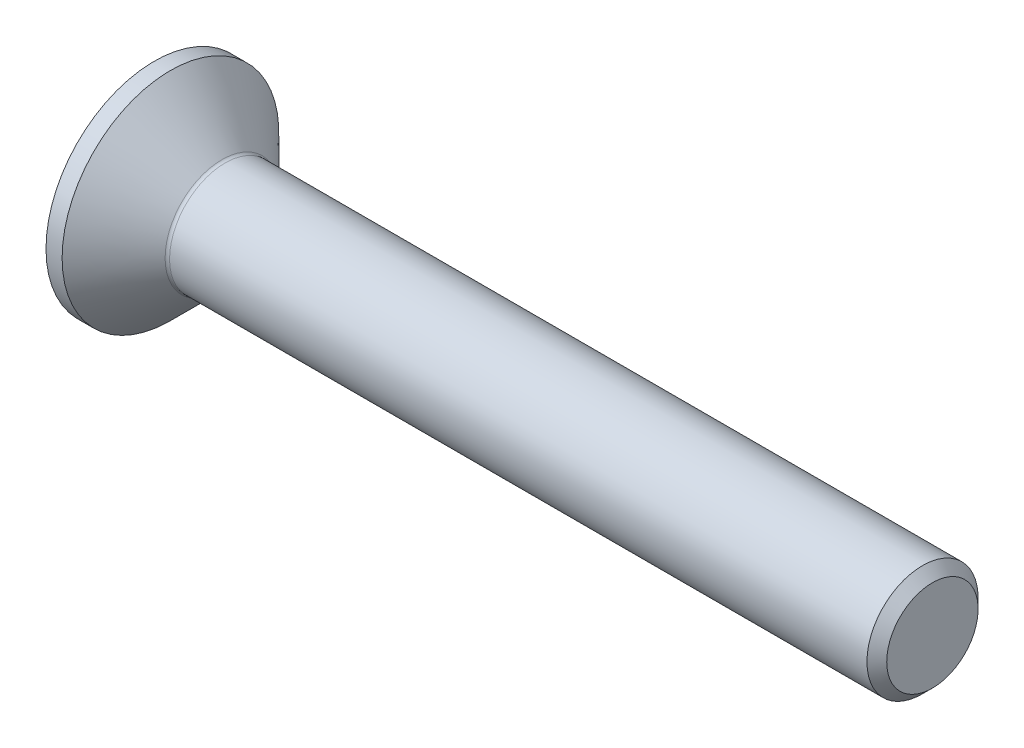
ISO-10303-21;
HEADER;
FILE_DESCRIPTION(('STEP AP214'),'2;1');
FILE_NAME('part.step','',(''),(''),'','','');
FILE_SCHEMA(('AUTOMOTIVE_DESIGN { 1 0 10303 214 1 1 1 1 }'));
ENDSEC;
DATA;
#1=APPLICATION_CONTEXT('core data for automotive mechanical design processes');
#2=APPLICATION_PROTOCOL_DEFINITION('international standard','automotive_design',2000,#1);
#3=PRODUCT_CONTEXT('',#1,'mechanical');
#4=PRODUCT('Part','Part','',(#3));
#5=PRODUCT_RELATED_PRODUCT_CATEGORY('part','',(#4));
#6=PRODUCT_DEFINITION_FORMATION('','',#4);
#7=PRODUCT_DEFINITION_CONTEXT('part definition',#1,'design');
#8=PRODUCT_DEFINITION('design','',#6,#7);
#9=PRODUCT_DEFINITION_SHAPE('','',#8);
#10=(LENGTH_UNIT() NAMED_UNIT(*) SI_UNIT(.MILLI.,.METRE.));
#11=(NAMED_UNIT(*) PLANE_ANGLE_UNIT() SI_UNIT($,.RADIAN.));
#12=(NAMED_UNIT(*) SI_UNIT($,.STERADIAN.) SOLID_ANGLE_UNIT());
#13=UNCERTAINTY_MEASURE_WITH_UNIT(LENGTH_MEASURE(1.E-05),#10,'distance_accuracy_value','');
#14=(GEOMETRIC_REPRESENTATION_CONTEXT(3) GLOBAL_UNCERTAINTY_ASSIGNED_CONTEXT((#13)) GLOBAL_UNIT_ASSIGNED_CONTEXT((#10,
#11,#12)) REPRESENTATION_CONTEXT('',''));
#15=CARTESIAN_POINT('',(0.,0.,0.));
#16=DIRECTION('',(0.,0.,1.));
#17=DIRECTION('',(1.,0.,0.));
#18=AXIS2_PLACEMENT_3D('',#15,#16,#17);
#19=CARTESIAN_POINT('',(0.,0.,0.));
#20=DIRECTION('',(-1.,0.,0.));
#21=DIRECTION('',(0.,0.,1.));
#22=AXIS2_PLACEMENT_3D('',#19,#20,#21);
#23=PLANE('',#22);
#24=CARTESIAN_POINT('',(0.,0.,0.));
#25=DIRECTION('',(-1.,0.,0.));
#26=DIRECTION('',(0.,0.,1.));
#27=AXIS2_PLACEMENT_3D('',#24,#25,#26);
#28=CIRCLE('',#27,4.875);
#29=CARTESIAN_POINT('',(0.,0.,4.875));
#30=VERTEX_POINT('',#29);
#31=EDGE_CURVE('E157',#30,#30,#28,.T.);
#32=ORIENTED_EDGE('',*,*,#31,.T.);
#33=EDGE_LOOP('',(#32));
#34=FACE_BOUND('',#33,.T.);
#35=DIRECTION('',(0.,-0.5,-0.866025403784439));
#36=VECTOR('',#35,1.);
#37=CARTESIAN_POINT('',(0.,-0.866025403784439,1.5));
#38=LINE('',#37,#36);
#39=CARTESIAN_POINT('',(0.,-0.866025403784439,1.5));
#40=VERTEX_POINT('',#39);
#41=CARTESIAN_POINT('',(0.,-1.73205080756888,0.));
#42=VERTEX_POINT('',#41);
#43=EDGE_CURVE('E119',#40,#42,#38,.T.);
#44=ORIENTED_EDGE('',*,*,#43,.T.);
#45=DIRECTION('',(0.,0.500000000000001,-0.866025403784438));
#46=VECTOR('',#45,1.);
#47=CARTESIAN_POINT('',(0.,-1.73205080756888,0.));
#48=LINE('',#47,#46);
#49=CARTESIAN_POINT('',(0.,-0.866025403784438,-1.5));
#50=VERTEX_POINT('',#49);
#51=EDGE_CURVE('E49',#42,#50,#48,.T.);
#52=ORIENTED_EDGE('',*,*,#51,.T.);
#53=DIRECTION('',(0.,1.,0.));
#54=VECTOR('',#53,1.);
#55=CARTESIAN_POINT('',(0.,-0.866025403784438,-1.5));
#56=LINE('',#55,#54);
#57=CARTESIAN_POINT('',(0.,0.866025403784438,-1.5));
#58=VERTEX_POINT('',#57);
#59=EDGE_CURVE('E134',#50,#58,#56,.T.);
#60=ORIENTED_EDGE('',*,*,#59,.T.);
#61=DIRECTION('',(0.,0.499999999999999,0.866025403784439));
#62=VECTOR('',#61,1.);
#63=CARTESIAN_POINT('',(0.,0.866025403784438,-1.5));
#64=LINE('',#63,#62);
#65=CARTESIAN_POINT('',(0.,1.73205080756888,0.));
#66=VERTEX_POINT('',#65);
#67=EDGE_CURVE('E270',#58,#66,#64,.T.);
#68=ORIENTED_EDGE('',*,*,#67,.T.);
#69=DIRECTION('',(0.,-0.5,0.866025403784439));
#70=VECTOR('',#69,1.);
#71=CARTESIAN_POINT('',(0.,1.73205080756888,0.));
#72=LINE('',#71,#70);
#73=CARTESIAN_POINT('',(0.,0.866025403784438,1.5));
#74=VERTEX_POINT('',#73);
#75=EDGE_CURVE('E273',#66,#74,#72,.T.);
#76=ORIENTED_EDGE('',*,*,#75,.T.);
#77=DIRECTION('',(0.,-1.,0.));
#78=VECTOR('',#77,1.);
#79=CARTESIAN_POINT('',(0.,0.866025403784438,1.5));
#80=LINE('',#79,#78);
#81=EDGE_CURVE('E276',#74,#40,#80,.T.);
#82=ORIENTED_EDGE('',*,*,#81,.T.);
#83=EDGE_LOOP('',(#44,#52,#60,#68,#76,#82));
#84=FACE_BOUND('',#83,.T.);
#85=ADVANCED_FACE('F34',(#34,#84),#23,.T.);
#86=CARTESIAN_POINT('',(0.,0.,0.));
#87=DIRECTION('',(-1.,0.,0.));
#88=DIRECTION('',(0.,0.,1.));
#89=AXIS2_PLACEMENT_3D('',#86,#87,#88);
#90=CYLINDRICAL_SURFACE('',#89,4.875);
#91=CARTESIAN_POINT('',(0.725000000000013,0.,0.));
#92=DIRECTION('',(-1.,0.,0.));
#93=DIRECTION('',(0.,0.,1.));
#94=AXIS2_PLACEMENT_3D('',#91,#92,#93);
#95=CIRCLE('',#94,4.875);
#96=CARTESIAN_POINT('',(0.725000000000013,0.,4.875));
#97=VERTEX_POINT('',#96);
#98=EDGE_CURVE('E154',#97,#97,#95,.T.);
#99=ORIENTED_EDGE('',*,*,#98,.T.);
#100=EDGE_LOOP('',(#99));
#101=FACE_BOUND('',#100,.T.);
#102=ORIENTED_EDGE('',*,*,#31,.F.);
#103=EDGE_LOOP('',(#102));
#104=FACE_BOUND('',#103,.T.);
#105=ADVANCED_FACE('F178',(#101,#104),#90,.T.);
#106=CARTESIAN_POINT('',(0.725000000000013,0.,0.));
#107=DIRECTION('',(-1.,0.,0.));
#108=DIRECTION('',(0.,0.,1.));
#109=AXIS2_PLACEMENT_3D('',#106,#107,#108);
#110=CONICAL_SURFACE('',#109,4.875,0.78539816339745);
#111=CARTESIAN_POINT('',(3.04142135623743,0.,0.));
#112=DIRECTION('',(-1.,0.,0.));
#113=DIRECTION('',(0.,0.,1.));
#114=AXIS2_PLACEMENT_3D('',#111,#112,#113);
#115=CIRCLE('',#114,2.55857864376258);
#116=CARTESIAN_POINT('',(3.04142135623743,0.,2.55857864376258));
#117=VERTEX_POINT('',#116);
#118=EDGE_CURVE('E42',#117,#117,#115,.T.);
#119=ORIENTED_EDGE('',*,*,#118,.T.);
#120=EDGE_LOOP('',(#119));
#121=FACE_BOUND('',#120,.T.);
#122=ORIENTED_EDGE('',*,*,#98,.F.);
#123=EDGE_LOOP('',(#122));
#124=FACE_BOUND('',#123,.T.);
#125=ADVANCED_FACE('F162',(#121,#124),#110,.T.);
#126=CARTESIAN_POINT('',(0.,0.,0.));
#127=DIRECTION('',(-1.,0.,0.));
#128=DIRECTION('',(0.,0.,1.));
#129=AXIS2_PLACEMENT_3D('',#126,#127,#128);
#130=CYLINDRICAL_SURFACE('',#129,2.49999999999989);
#131=CARTESIAN_POINT('',(3.18284271247473,0.,0.));
#132=DIRECTION('',(-1.,0.,0.));
#133=DIRECTION('',(0.,0.,1.));
#134=AXIS2_PLACEMENT_3D('',#131,#132,#133);
#135=CIRCLE('',#134,2.49999999999989);
#136=CARTESIAN_POINT('',(3.18284271247473,0.,2.49999999999989));
#137=VERTEX_POINT('',#136);
#138=EDGE_CURVE('E11',#137,#137,#135,.F.);
#139=ORIENTED_EDGE('',*,*,#138,.T.);
#140=EDGE_LOOP('',(#139));
#141=FACE_BOUND('',#140,.T.);
#142=CARTESIAN_POINT('',(34.5549999999998,0.,0.));
#143=DIRECTION('',(-1.,0.,0.));
#144=DIRECTION('',(0.,0.,1.));
#145=AXIS2_PLACEMENT_3D('',#142,#143,#144);
#146=CIRCLE('',#145,2.49999999999977);
#147=CARTESIAN_POINT('',(34.5549999999998,0.,2.49999999999977));
#148=VERTEX_POINT('',#147);
#149=EDGE_CURVE('E151',#148,#148,#146,.T.);
#150=ORIENTED_EDGE('',*,*,#149,.T.);
#151=EDGE_LOOP('',(#150));
#152=FACE_BOUND('',#151,.T.);
#153=ADVANCED_FACE('F189',(#141,#152),#130,.T.);
#154=CARTESIAN_POINT('',(35.,0.,0.));
#155=DIRECTION('',(-1.,0.,0.));
#156=DIRECTION('',(0.,0.,1.));
#157=AXIS2_PLACEMENT_3D('',#154,#155,#156);
#158=CONICAL_SURFACE('',#157,2.055,0.785398163396951);
#159=ORIENTED_EDGE('',*,*,#149,.F.);
#160=EDGE_LOOP('',(#159));
#161=FACE_BOUND('',#160,.T.);
#162=CARTESIAN_POINT('',(35.,0.,0.));
#163=DIRECTION('',(-1.,0.,0.));
#164=DIRECTION('',(0.,0.,1.));
#165=AXIS2_PLACEMENT_3D('',#162,#163,#164);
#166=CIRCLE('',#165,2.055);
#167=CARTESIAN_POINT('',(35.,0.,2.055));
#168=VERTEX_POINT('',#167);
#169=EDGE_CURVE('E147',#168,#168,#166,.T.);
#170=ORIENTED_EDGE('',*,*,#169,.T.);
#171=EDGE_LOOP('',(#170));
#172=FACE_BOUND('',#171,.T.);
#173=ADVANCED_FACE('F173',(#161,#172),#158,.T.);
#174=CARTESIAN_POINT('',(35.,2.055,0.));
#175=DIRECTION('',(1.,0.,0.));
#176=DIRECTION('',(0.,0.,-1.));
#177=AXIS2_PLACEMENT_3D('',#174,#175,#176);
#178=PLANE('',#177);
#179=ORIENTED_EDGE('',*,*,#169,.F.);
#180=EDGE_LOOP('',(#179));
#181=FACE_BOUND('',#180,.T.);
#182=ADVANCED_FACE('F166',(#181),#178,.T.);
#183=CARTESIAN_POINT('',(3.18284271247473,0.,0.));
#184=DIRECTION('',(-1.,0.,0.));
#185=DIRECTION('',(0.,0.,1.));
#186=AXIS2_PLACEMENT_3D('',#183,#184,#185);
#187=TOROIDAL_SURFACE('',#186,2.69999999999989,0.2);
#188=ORIENTED_EDGE('',*,*,#138,.F.);
#189=EDGE_LOOP('',(#188));
#190=FACE_BOUND('',#189,.T.);
#191=ORIENTED_EDGE('',*,*,#118,.F.);
#192=EDGE_LOOP('',(#191));
#193=FACE_BOUND('',#192,.T.);
#194=ADVANCED_FACE('F36',(#190,#193),#187,.F.);
#195=CARTESIAN_POINT('',(1.9,-1.73205080756888,0.));
#196=DIRECTION('',(0.,0.866025403784438,0.500000000000001));
#197=DIRECTION('',(0.,-0.500000000000001,0.866025403784438));
#198=AXIS2_PLACEMENT_3D('',#195,#196,#197);
#199=PLANE('',#198);
#200=ORIENTED_EDGE('',*,*,#51,.F.);
#201=DIRECTION('',(-1.,0.,0.));
#202=VECTOR('',#201,1.);
#203=CARTESIAN_POINT('',(1.9,-1.73205080756888,0.));
#204=LINE('',#203,#202);
#205=CARTESIAN_POINT('',(1.9,-1.73205080756888,0.));
#206=VERTEX_POINT('',#205);
#207=EDGE_CURVE('E267',#206,#42,#204,.T.);
#208=ORIENTED_EDGE('',*,*,#207,.F.);
#209=DIRECTION('',(0.,0.500000000000001,-0.866025403784438));
#210=VECTOR('',#209,1.);
#211=CARTESIAN_POINT('',(1.9,-1.73205080756888,0.));
#212=LINE('',#211,#210);
#213=CARTESIAN_POINT('',(1.9,-1.29903810567666,-0.750000000000001));
#214=VERTEX_POINT('',#213);
#215=EDGE_CURVE('E116',#206,#214,#212,.T.);
#216=ORIENTED_EDGE('',*,*,#215,.T.);
#217=CARTESIAN_POINT('',(1.9,-0.866025403784438,-1.5));
#218=VERTEX_POINT('',#217);
#219=EDGE_CURVE('E110',#214,#218,#212,.T.);
#220=ORIENTED_EDGE('',*,*,#219,.T.);
#221=DIRECTION('',(-1.,0.,0.));
#222=VECTOR('',#221,1.);
#223=CARTESIAN_POINT('',(1.9,-0.866025403784438,-1.5));
#224=LINE('',#223,#222);
#225=EDGE_CURVE('E114',#218,#50,#224,.T.);
#226=ORIENTED_EDGE('',*,*,#225,.T.);
#227=EDGE_LOOP('',(#200,#208,#216,#220,#226));
#228=FACE_BOUND('',#227,.T.);
#229=ADVANCED_FACE('F112',(#228),#199,.T.);
#230=CARTESIAN_POINT('',(1.9,-0.866025403784438,-1.5));
#231=DIRECTION('',(0.,0.,1.));
#232=DIRECTION('',(0.,-1.,0.));
#233=AXIS2_PLACEMENT_3D('',#230,#231,#232);
#234=PLANE('',#233);
#235=ORIENTED_EDGE('',*,*,#59,.F.);
#236=ORIENTED_EDGE('',*,*,#225,.F.);
#237=DIRECTION('',(0.,1.,0.));
#238=VECTOR('',#237,1.);
#239=CARTESIAN_POINT('',(1.9,-0.866025403784438,-1.5));
#240=LINE('',#239,#238);
#241=CARTESIAN_POINT('',(1.9,0.,-1.5));
#242=VERTEX_POINT('',#241);
#243=EDGE_CURVE('E122',#218,#242,#240,.T.);
#244=ORIENTED_EDGE('',*,*,#243,.T.);
#245=CARTESIAN_POINT('',(1.9,0.866025403784438,-1.5));
#246=VERTEX_POINT('',#245);
#247=EDGE_CURVE('E129',#242,#246,#240,.T.);
#248=ORIENTED_EDGE('',*,*,#247,.T.);
#249=DIRECTION('',(-1.,0.,0.));
#250=VECTOR('',#249,1.);
#251=CARTESIAN_POINT('',(1.9,0.866025403784438,-1.5));
#252=LINE('',#251,#250);
#253=EDGE_CURVE('E136',#246,#58,#252,.T.);
#254=ORIENTED_EDGE('',*,*,#253,.T.);
#255=EDGE_LOOP('',(#235,#236,#244,#248,#254));
#256=FACE_BOUND('',#255,.T.);
#257=ADVANCED_FACE('F131',(#256),#234,.T.);
#258=CARTESIAN_POINT('',(1.9,0.866025403784438,-1.5));
#259=DIRECTION('',(0.,-0.866025403784439,0.499999999999999));
#260=DIRECTION('',(0.,-0.499999999999999,-0.866025403784439));
#261=AXIS2_PLACEMENT_3D('',#258,#259,#260);
#262=PLANE('',#261);
#263=ORIENTED_EDGE('',*,*,#67,.F.);
#264=ORIENTED_EDGE('',*,*,#253,.F.);
#265=DIRECTION('',(0.,0.499999999999999,0.866025403784439));
#266=VECTOR('',#265,1.);
#267=CARTESIAN_POINT('',(1.9,0.866025403784438,-1.5));
#268=LINE('',#267,#266);
#269=CARTESIAN_POINT('',(1.9,1.29903810567666,-0.749999999999998));
#270=VERTEX_POINT('',#269);
#271=EDGE_CURVE('E259',#246,#270,#268,.T.);
#272=ORIENTED_EDGE('',*,*,#271,.T.);
#273=CARTESIAN_POINT('',(1.9,1.73205080756888,0.));
#274=VERTEX_POINT('',#273);
#275=EDGE_CURVE('E128',#270,#274,#268,.T.);
#276=ORIENTED_EDGE('',*,*,#275,.T.);
#277=DIRECTION('',(-1.,0.,0.));
#278=VECTOR('',#277,1.);
#279=CARTESIAN_POINT('',(1.9,1.73205080756888,0.));
#280=LINE('',#279,#278);
#281=EDGE_CURVE('E142',#274,#66,#280,.T.);
#282=ORIENTED_EDGE('',*,*,#281,.T.);
#283=EDGE_LOOP('',(#263,#264,#272,#276,#282));
#284=FACE_BOUND('',#283,.T.);
#285=ADVANCED_FACE('F203',(#284),#262,.T.);
#286=CARTESIAN_POINT('',(1.9,1.73205080756888,0.));
#287=DIRECTION('',(0.,-0.866025403784439,-0.5));
#288=DIRECTION('',(0.,0.5,-0.866025403784439));
#289=AXIS2_PLACEMENT_3D('',#286,#287,#288);
#290=PLANE('',#289);
#291=ORIENTED_EDGE('',*,*,#75,.F.);
#292=ORIENTED_EDGE('',*,*,#281,.F.);
#293=DIRECTION('',(0.,-0.5,0.866025403784439));
#294=VECTOR('',#293,1.);
#295=CARTESIAN_POINT('',(1.9,1.73205080756888,0.));
#296=LINE('',#295,#294);
#297=CARTESIAN_POINT('',(1.9,1.29903810567666,0.749999999999999));
#298=VERTEX_POINT('',#297);
#299=EDGE_CURVE('E57',#274,#298,#296,.T.);
#300=ORIENTED_EDGE('',*,*,#299,.T.);
#301=CARTESIAN_POINT('',(1.9,0.866025403784438,1.5));
#302=VERTEX_POINT('',#301);
#303=EDGE_CURVE('E238',#298,#302,#296,.T.);
#304=ORIENTED_EDGE('',*,*,#303,.T.);
#305=DIRECTION('',(-1.,0.,0.));
#306=VECTOR('',#305,1.);
#307=CARTESIAN_POINT('',(1.9,0.866025403784438,1.5));
#308=LINE('',#307,#306);
#309=EDGE_CURVE('E252',#302,#74,#308,.T.);
#310=ORIENTED_EDGE('',*,*,#309,.T.);
#311=EDGE_LOOP('',(#291,#292,#300,#304,#310));
#312=FACE_BOUND('',#311,.T.);
#313=ADVANCED_FACE('F206',(#312),#290,.T.);
#314=CARTESIAN_POINT('',(1.9,0.866025403784438,1.5));
#315=DIRECTION('',(0.,0.,-1.));
#316=DIRECTION('',(0.,1.,0.));
#317=AXIS2_PLACEMENT_3D('',#314,#315,#316);
#318=PLANE('',#317);
#319=ORIENTED_EDGE('',*,*,#81,.F.);
#320=ORIENTED_EDGE('',*,*,#309,.F.);
#321=DIRECTION('',(0.,-1.,0.));
#322=VECTOR('',#321,1.);
#323=CARTESIAN_POINT('',(1.9,0.866025403784438,1.5));
#324=LINE('',#323,#322);
#325=CARTESIAN_POINT('',(1.9,0.,1.5));
#326=VERTEX_POINT('',#325);
#327=EDGE_CURVE('E237',#302,#326,#324,.T.);
#328=ORIENTED_EDGE('',*,*,#327,.T.);
#329=CARTESIAN_POINT('',(1.9,-0.866025403784439,1.5));
#330=VERTEX_POINT('',#329);
#331=EDGE_CURVE('E243',#326,#330,#324,.T.);
#332=ORIENTED_EDGE('',*,*,#331,.T.);
#333=DIRECTION('',(-1.,0.,0.));
#334=VECTOR('',#333,1.);
#335=CARTESIAN_POINT('',(1.9,-0.866025403784439,1.5));
#336=LINE('',#335,#334);
#337=EDGE_CURVE('E282',#330,#40,#336,.T.);
#338=ORIENTED_EDGE('',*,*,#337,.T.);
#339=EDGE_LOOP('',(#319,#320,#328,#332,#338));
#340=FACE_BOUND('',#339,.T.);
#341=ADVANCED_FACE('F210',(#340),#318,.T.);
#342=CARTESIAN_POINT('',(1.9,-0.866025403784439,1.5));
#343=DIRECTION('',(0.,0.866025403784438,-0.5));
#344=DIRECTION('',(0.,0.5,0.866025403784439));
#345=AXIS2_PLACEMENT_3D('',#342,#343,#344);
#346=PLANE('',#345);
#347=ORIENTED_EDGE('',*,*,#43,.F.);
#348=ORIENTED_EDGE('',*,*,#337,.F.);
#349=DIRECTION('',(0.,-0.5,-0.866025403784439));
#350=VECTOR('',#349,1.);
#351=CARTESIAN_POINT('',(1.9,-0.866025403784439,1.5));
#352=LINE('',#351,#350);
#353=CARTESIAN_POINT('',(1.9,-1.29903810567666,0.75));
#354=VERTEX_POINT('',#353);
#355=EDGE_CURVE('E246',#330,#354,#352,.T.);
#356=ORIENTED_EDGE('',*,*,#355,.T.);
#357=EDGE_CURVE('E253',#354,#206,#352,.T.);
#358=ORIENTED_EDGE('',*,*,#357,.T.);
#359=ORIENTED_EDGE('',*,*,#207,.T.);
#360=EDGE_LOOP('',(#347,#348,#356,#358,#359));
#361=FACE_BOUND('',#360,.T.);
#362=ADVANCED_FACE('F213',(#361),#346,.T.);
#363=CARTESIAN_POINT('',(1.9,-1.73205080756888,0.));
#364=DIRECTION('',(-1.,0.,0.));
#365=DIRECTION('',(0.,0.,1.));
#366=AXIS2_PLACEMENT_3D('',#363,#364,#365);
#367=PLANE('',#366);
#368=CARTESIAN_POINT('',(1.9,0.,0.));
#369=DIRECTION('',(-1.,0.,0.));
#370=DIRECTION('',(0.,0.,1.));
#371=AXIS2_PLACEMENT_3D('',#368,#369,#370);
#372=CIRCLE('',#371,1.5);
#373=EDGE_CURVE('E135',#354,#326,#372,.T.);
#374=ORIENTED_EDGE('',*,*,#373,.F.);
#375=ORIENTED_EDGE('',*,*,#355,.F.);
#376=ORIENTED_EDGE('',*,*,#331,.F.);
#377=EDGE_LOOP('',(#374,#375,#376));
#378=FACE_BOUND('',#377,.T.);
#379=ADVANCED_FACE('F217',(#378),#367,.T.);
#380=EDGE_CURVE('E139',#214,#354,#372,.T.);
#381=ORIENTED_EDGE('',*,*,#380,.F.);
#382=ORIENTED_EDGE('',*,*,#215,.F.);
#383=ORIENTED_EDGE('',*,*,#357,.F.);
#384=EDGE_LOOP('',(#381,#382,#383));
#385=FACE_BOUND('',#384,.T.);
#386=ADVANCED_FACE('F220',(#385),#367,.T.);
#387=EDGE_CURVE('E124',#242,#214,#372,.T.);
#388=ORIENTED_EDGE('',*,*,#387,.F.);
#389=ORIENTED_EDGE('',*,*,#243,.F.);
#390=ORIENTED_EDGE('',*,*,#219,.F.);
#391=EDGE_LOOP('',(#388,#389,#390));
#392=FACE_BOUND('',#391,.T.);
#393=ADVANCED_FACE('F123',(#392),#367,.T.);
#394=EDGE_CURVE('E255',#270,#242,#372,.T.);
#395=ORIENTED_EDGE('',*,*,#394,.F.);
#396=ORIENTED_EDGE('',*,*,#271,.F.);
#397=ORIENTED_EDGE('',*,*,#247,.F.);
#398=EDGE_LOOP('',(#395,#396,#397));
#399=FACE_BOUND('',#398,.T.);
#400=ADVANCED_FACE('F232',(#399),#367,.T.);
#401=EDGE_CURVE('E148',#298,#270,#372,.T.);
#402=ORIENTED_EDGE('',*,*,#401,.F.);
#403=ORIENTED_EDGE('',*,*,#299,.F.);
#404=ORIENTED_EDGE('',*,*,#275,.F.);
#405=EDGE_LOOP('',(#402,#403,#404));
#406=FACE_BOUND('',#405,.T.);
#407=ADVANCED_FACE('F227',(#406),#367,.T.);
#408=EDGE_CURVE('E141',#326,#298,#372,.T.);
#409=ORIENTED_EDGE('',*,*,#408,.F.);
#410=ORIENTED_EDGE('',*,*,#327,.F.);
#411=ORIENTED_EDGE('',*,*,#303,.F.);
#412=EDGE_LOOP('',(#409,#410,#411));
#413=FACE_BOUND('',#412,.T.);
#414=ADVANCED_FACE('F198',(#413),#367,.T.);
#415=CARTESIAN_POINT('',(1.9,0.,0.));
#416=DIRECTION('',(-1.,0.,0.));
#417=DIRECTION('',(0.,0.,1.));
#418=AXIS2_PLACEMENT_3D('',#415,#416,#417);
#419=CONICAL_SURFACE('',#418,1.5,1.04719755119659);
#420=CARTESIAN_POINT('',(2.76602540378445,0.,0.));
#421=VERTEX_POINT('',#420);
#422=VERTEX_LOOP('',#421);
#423=FACE_BOUND('',#422,.T.);
#424=ORIENTED_EDGE('',*,*,#408,.T.);
#425=ORIENTED_EDGE('',*,*,#401,.T.);
#426=ORIENTED_EDGE('',*,*,#394,.T.);
#427=ORIENTED_EDGE('',*,*,#387,.T.);
#428=ORIENTED_EDGE('',*,*,#380,.T.);
#429=ORIENTED_EDGE('',*,*,#373,.T.);
#430=EDGE_LOOP('',(#424,#425,#426,#427,#428,#429));
#431=FACE_BOUND('',#430,.T.);
#432=ADVANCED_FACE('F196',(#423,#431),#419,.F.);
#433=CLOSED_SHELL('',(#85,#105,#125,#153,#173,#182,#194,#229,#257,#285,#313,#341,#362,#379,#386,
#393,#400,#407,#414,#432));
#434=MANIFOLD_SOLID_BREP('B2',#433);
#435=ADVANCED_BREP_SHAPE_REPRESENTATION('',(#18,#434),#14);
#436=SHAPE_DEFINITION_REPRESENTATION(#9,#435);
ENDSEC;
END-ISO-10303-21;
